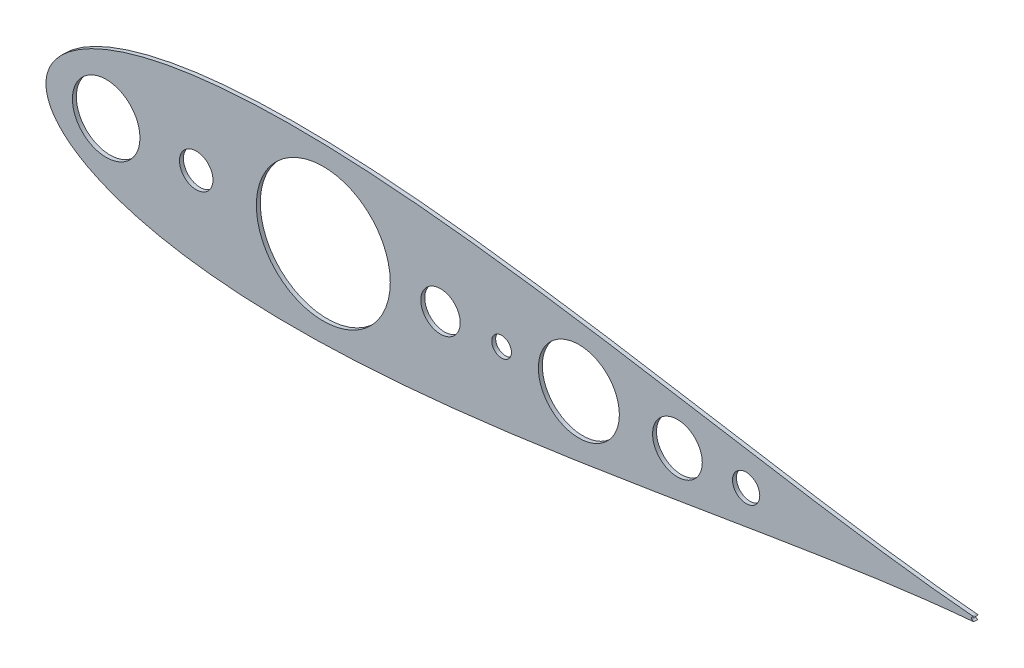
ISO-10303-21;
HEADER;
FILE_DESCRIPTION(('STEP AP214'),'2;1');
FILE_NAME('part.step','',(''),(''),'','','');
FILE_SCHEMA(('AUTOMOTIVE_DESIGN { 1 0 10303 214 1 1 1 1 }'));
ENDSEC;
DATA;
#1=APPLICATION_CONTEXT('core data for automotive mechanical design processes');
#2=APPLICATION_PROTOCOL_DEFINITION('international standard','automotive_design',2000,#1);
#3=PRODUCT_CONTEXT('',#1,'mechanical');
#4=PRODUCT('Part','Part','',(#3));
#5=PRODUCT_RELATED_PRODUCT_CATEGORY('part','',(#4));
#6=PRODUCT_DEFINITION_FORMATION('','',#4);
#7=PRODUCT_DEFINITION_CONTEXT('part definition',#1,'design');
#8=PRODUCT_DEFINITION('design','',#6,#7);
#9=PRODUCT_DEFINITION_SHAPE('','',#8);
#10=(LENGTH_UNIT() NAMED_UNIT(*) SI_UNIT(.MILLI.,.METRE.));
#11=(NAMED_UNIT(*) PLANE_ANGLE_UNIT() SI_UNIT($,.RADIAN.));
#12=(NAMED_UNIT(*) SI_UNIT($,.STERADIAN.) SOLID_ANGLE_UNIT());
#13=UNCERTAINTY_MEASURE_WITH_UNIT(LENGTH_MEASURE(1.E-05),#10,'distance_accuracy_value','');
#14=(GEOMETRIC_REPRESENTATION_CONTEXT(3) GLOBAL_UNCERTAINTY_ASSIGNED_CONTEXT((#13)) GLOBAL_UNIT_ASSIGNED_CONTEXT((#10,
#11,#12)) REPRESENTATION_CONTEXT('',''));
#15=CARTESIAN_POINT('',(0.,0.,0.));
#16=DIRECTION('',(0.,0.,1.));
#17=DIRECTION('',(1.,0.,0.));
#18=AXIS2_PLACEMENT_3D('',#15,#16,#17);
#19=CARTESIAN_POINT('',(-96.8502000029541,3.77820742338118E-09,2.53999999999976));
#20=DIRECTION('',(0.,0.,0.999999999999998));
#21=DIRECTION('',(1.,0.,0.));
#22=AXIS2_PLACEMENT_3D('',#19,#20,#21);
#23=PLANE('',#22);
#24=CARTESIAN_POINT('',(246.65660847904,0.,2.53999999999976));
#25=DIRECTION('',(0.,0.,0.999999999999998));
#26=DIRECTION('',(1.,0.,0.));
#27=AXIS2_PLACEMENT_3D('',#24,#25,#26);
#28=CIRCLE('',#27,26.1031659501041);
#29=CARTESIAN_POINT('',(272.759774429144,0.,2.53999999999976));
#30=VERTEX_POINT('',#29);
#31=EDGE_CURVE('E203',#30,#30,#28,.T.);
#32=ORIENTED_EDGE('',*,*,#31,.F.);
#33=EDGE_LOOP('',(#32));
#34=FACE_BOUND('',#33,.T.);
#35=CARTESIAN_POINT('',(354.48626357368,-1.5908517438254E-13,2.53999999999976));
#36=DIRECTION('',(0.,0.,0.999999999999998));
#37=DIRECTION('',(1.,0.,0.));
#38=AXIS2_PLACEMENT_3D('',#35,#36,#37);
#39=CIRCLE('',#38,8.77991454979843);
#40=CARTESIAN_POINT('',(363.266178123479,-1.5908517438254E-13,2.53999999999976));
#41=VERTEX_POINT('',#40);
#42=EDGE_CURVE('E188',#41,#41,#39,.T.);
#43=ORIENTED_EDGE('',*,*,#42,.F.);
#44=EDGE_LOOP('',(#43));
#45=FACE_BOUND('',#44,.T.);
#46=CARTESIAN_POINT('',(196.85,0.,2.53999999999976));
#47=DIRECTION('',(0.,0.,0.999999999999998));
#48=DIRECTION('',(1.,0.,0.));
#49=AXIS2_PLACEMENT_3D('',#46,#47,#48);
#50=CIRCLE('',#49,6.35000000000008);
#51=CARTESIAN_POINT('',(203.2,0.,2.53999999999976));
#52=VERTEX_POINT('',#51);
#53=EDGE_CURVE('E172',#52,#52,#50,.T.);
#54=ORIENTED_EDGE('',*,*,#53,.F.);
#55=EDGE_LOOP('',(#54));
#56=FACE_BOUND('',#55,.T.);
#57=CARTESIAN_POINT('',(0.,0.,2.53999999999976));
#58=DIRECTION('',(0.,0.,0.999999999999998));
#59=DIRECTION('',(1.,0.,0.));
#60=AXIS2_PLACEMENT_3D('',#57,#58,#59);
#61=CIRCLE('',#60,10.795);
#62=CARTESIAN_POINT('',(10.795,0.,2.53999999999976));
#63=VERTEX_POINT('',#62);
#64=EDGE_CURVE('E134',#63,#63,#61,.T.);
#65=ORIENTED_EDGE('',*,*,#64,.F.);
#66=EDGE_LOOP('',(#65));
#67=FACE_BOUND('',#66,.T.);
#68=CARTESIAN_POINT('',(500.684889832727,1.47129637578877,2.53999999999976));
#69=CARTESIAN_POINT('',(500.203654886732,1.51131569020501,2.53999999999976));
#70=CARTESIAN_POINT('',(496.576967435612,1.81679816270618,2.53999999999976));
#71=CARTESIAN_POINT('',(489.434650236646,2.4769485124724,2.53999999999976));
#72=CARTESIAN_POINT('',(478.832935496631,3.57980591137699,2.53999999999976));
#73=CARTESIAN_POINT('',(467.07853931356,4.93311895836878,2.53999999999976));
#74=CARTESIAN_POINT('',(454.215647937128,6.54500046738107,2.53999999999976));
#75=CARTESIAN_POINT('',(440.30427230571,8.41709162052653,2.53999999999976));
#76=CARTESIAN_POINT('',(425.40457178013,10.545195254945,2.53999999999976));
#77=CARTESIAN_POINT('',(409.581067446624,12.9183188024482,2.53999999999976));
#78=CARTESIAN_POINT('',(392.900953598627,15.5195803040389,2.53999999999976));
#79=CARTESIAN_POINT('',(375.434110153833,18.3257538503156,2.53999999999976));
#80=CARTESIAN_POINT('',(357.252720565313,21.3078555226196,2.53999999999976));
#81=CARTESIAN_POINT('',(338.431061990196,24.4315055397159,2.53999999999976));
#82=CARTESIAN_POINT('',(319.045264622353,27.657276915494,2.53999999999976));
#83=CARTESIAN_POINT('',(299.17318412093,30.9414014359741,2.53999999999976));
#84=CARTESIAN_POINT('',(278.894273560953,34.2362951107011,2.53999999999976));
#85=CARTESIAN_POINT('',(258.28951645273,37.4913381802728,2.53999999999976));
#86=CARTESIAN_POINT('',(237.441382849572,40.6535573588189,2.53999999999976));
#87=CARTESIAN_POINT('',(216.433826056586,43.668566138567,2.53999999999976));
#88=CARTESIAN_POINT('',(195.352272800007,46.4812548262623,2.53999999999976));
#89=CARTESIAN_POINT('',(174.283643961756,49.0367728183969,2.53999999999976));
#90=CARTESIAN_POINT('',(153.316369016064,51.2813169445907,2.53999999999976));
#91=CARTESIAN_POINT('',(132.540399541543,53.1630815645665,2.53999999999976));
#92=CARTESIAN_POINT('',(112.047200631443,54.633014280075,2.53999999999976));
#93=CARTESIAN_POINT('',(91.9297491144909,55.6457331849992,2.53999999999976));
#94=CARTESIAN_POINT('',(72.2825133299653,56.1603807159495,2.53999999999976));
#95=CARTESIAN_POINT('',(53.2014209917539,56.1412740352254,2.53999999999976));
#96=CARTESIAN_POINT('',(34.7838914570601,55.5581031204121,2.53999999999976));
#97=CARTESIAN_POINT('',(17.1288372498444,54.3880350403485,2.53999999999976));
#98=CARTESIAN_POINT('',(0.3369514843376,52.6141026607641,2.53999999999976));
#99=CARTESIAN_POINT('',(-15.4891326713303,50.2283097390018,2.53999999999976));
#100=CARTESIAN_POINT('',(-30.2438826455875,47.2298193665639,2.53999999999976));
#101=CARTESIAN_POINT('',(-43.8181499589832,43.6286650547727,2.53999999999976));
#102=CARTESIAN_POINT('',(-56.0971774760284,39.4459522916723,2.53999999999976));
#103=CARTESIAN_POINT('',(-66.9584699307936,34.7189497504188,2.53999999999976));
#104=CARTESIAN_POINT('',(-76.2701301439071,29.5102534688845,2.53999999999976));
#105=CARTESIAN_POINT('',(-83.893046125715,23.9255632623146,2.53999999999976));
#106=CARTESIAN_POINT('',(-89.6988566680927,18.1472831014575,2.53999999999976));
#107=CARTESIAN_POINT('',(-93.6294832038793,12.4809296149927,2.53999999999976));
#108=CARTESIAN_POINT('',(-95.8213101013169,7.36875217806998,2.53999999999976));
#109=CARTESIAN_POINT('',(-96.7064112320907,3.26783085579577,2.53999999999976));
#110=CARTESIAN_POINT('',(-96.9080009887283,3.77797843988235E-09,2.53999999999976));
#111=CARTESIAN_POINT('',(-96.7064112320907,-3.26783084824001,2.53999999999976));
#112=CARTESIAN_POINT('',(-95.8213101013169,-7.36875217051411,2.53999999999976));
#113=CARTESIAN_POINT('',(-93.6294832038793,-12.4809296074369,2.53999999999976));
#114=CARTESIAN_POINT('',(-89.6988566680928,-18.1472830939015,2.53999999999976));
#115=CARTESIAN_POINT('',(-83.893046125715,-23.9255632547589,2.53999999999976));
#116=CARTESIAN_POINT('',(-76.270130143907,-29.5102534613288,2.53999999999976));
#117=CARTESIAN_POINT('',(-66.9584699307936,-34.718949742863,2.53999999999976));
#118=CARTESIAN_POINT('',(-56.0971774760283,-39.4459522841168,2.53999999999976));
#119=CARTESIAN_POINT('',(-43.8181499589832,-43.6286650472169,2.53999999999976));
#120=CARTESIAN_POINT('',(-30.2438826455875,-47.2298193590082,2.53999999999976));
#121=CARTESIAN_POINT('',(-15.4891326713303,-50.228309731446,2.53999999999976));
#122=CARTESIAN_POINT('',(0.336951484337711,-52.6141026532085,2.53999999999976));
#123=CARTESIAN_POINT('',(17.1288372498441,-54.3880350327927,2.53999999999976));
#124=CARTESIAN_POINT('',(34.7838914570601,-55.5581031128562,2.53999999999976));
#125=CARTESIAN_POINT('',(53.2014209917539,-56.1412740276696,2.53999999999976));
#126=CARTESIAN_POINT('',(72.282513329965,-56.1603807083937,2.53999999999976));
#127=CARTESIAN_POINT('',(91.9297491144909,-55.6457331774434,2.53999999999976));
#128=CARTESIAN_POINT('',(112.047200631443,-54.6330142725192,2.53999999999976));
#129=CARTESIAN_POINT('',(132.540399541543,-53.1630815570107,2.53999999999976));
#130=CARTESIAN_POINT('',(153.316369016064,-51.2813169370346,2.53999999999976));
#131=CARTESIAN_POINT('',(174.283643961756,-49.0367728108412,2.53999999999976));
#132=CARTESIAN_POINT('',(195.352272800007,-46.4812548187066,2.53999999999976));
#133=CARTESIAN_POINT('',(216.433826056586,-43.6685661310111,2.53999999999976));
#134=CARTESIAN_POINT('',(237.441382849572,-40.6535573512632,2.53999999999976));
#135=CARTESIAN_POINT('',(258.28951645273,-37.491338172717,2.53999999999976));
#136=CARTESIAN_POINT('',(278.894273560954,-34.2362951031456,2.53999999999976));
#137=CARTESIAN_POINT('',(299.17318412093,-30.9414014284185,2.53999999999976));
#138=CARTESIAN_POINT('',(319.045264622353,-27.657276907938,2.53999999999976));
#139=CARTESIAN_POINT('',(338.431061990196,-24.4315055321601,2.53999999999976));
#140=CARTESIAN_POINT('',(357.252720565313,-21.3078555150639,2.53999999999976));
#141=CARTESIAN_POINT('',(375.434110153833,-18.3257538427601,2.53999999999976));
#142=CARTESIAN_POINT('',(392.900953598627,-15.5195802964833,2.53999999999976));
#143=CARTESIAN_POINT('',(409.581067446624,-12.9183187948922,2.53999999999976));
#144=CARTESIAN_POINT('',(425.40457178013,-10.5451952473894,2.53999999999976));
#145=CARTESIAN_POINT('',(440.30427230571,-8.41709161297103,2.53999999999976));
#146=CARTESIAN_POINT('',(454.215647937127,-6.54500045982587,2.53999999999976));
#147=CARTESIAN_POINT('',(467.07853931356,-4.93311895081337,2.53999999999976));
#148=CARTESIAN_POINT('',(478.83293549663,-3.57980590382138,2.53999999999976));
#149=CARTESIAN_POINT('',(489.434650236646,-2.47694850491707,2.53999999999976));
#150=CARTESIAN_POINT('',(496.576967435612,-1.81679815515038,2.53999999999976));
#151=CARTESIAN_POINT('',(500.203654886732,-1.51131568264918,2.53999999999976));
#152=CARTESIAN_POINT('',(500.684889832727,-1.47129637316293,2.53999999999976));
#153=B_SPLINE_CURVE_WITH_KNOTS('',3,(#68,#69,#70,#71,#72,#73,#74,#75,#76,#77,#78,#79,#80,#81,
#82,#83,#84,#85,#86,#87,#88,#89,#90,#91,#92,#93,#94,#95,#96,#97,#98,#99,#100,#101,#102,#103,
#104,#105,#106,#107,#108,#109,#110,#111,#112,#113,#114,#115,#116,#117,#118,#119,#120,#121,#122,
#123,#124,#125,#126,#127,#128,#129,#130,#131,#132,#133,#134,#135,#136,#137,#138,#139,#140,#141,
#142,#143,#144,#145,#146,#147,#148,#149,#150,#151,#152),.UNSPECIFIED.,.F.,.F.,(4,1,1,1,1,1,1,1,
1,1,1,1,1,1,1,1,1,1,1,1,1,1,1,1,1,1,1,1,1,1,1,1,1,1,1,1,1,1,1,1,1,1,1,1,1,1,1,1,1,1,1,1,1,1,1,1,
1,1,1,1,1,1,1,1,1,1,1,1,1,1,1,1,1,1,1,1,1,1,1,1,1,1,4),(0.020157042076269,0.0212708876900959,
0.0285525550130683,0.0367806836725549,0.0459201019032637,0.0559317636633187,0.0667728836144854,
0.0783971303496518,0.0907548266908363,0.103793164577546,0.117456431914319,0.131686225652521,
0.146421738497113,0.161599998000845,0.177156132626574,0.193023668070302,0.209134785631037,
0.225420632511523,0.241811601924249,0.258237646860869,0.274628556698349,0.290914287398014,
0.307025228908797,0.322892517177238,0.33844834182358,0.353626206573582,0.368361231970712,
0.382590427827798,0.396252960572084,0.40929041186716,0.421647009590257,0.433269881487031,
0.444109248914041,0.454118639688981,0.463255054987312,0.471479113777303,0.478755288570903,
0.485052318112802,0.490344025694165,0.494609832614287,0.497833231437255,0.5,0.502166768562745,
0.505390167385713,0.509655974305835,0.514947681887198,0.521244711429097,0.528520886222697,
0.536744945012688,0.545881360311019,0.555890751085959,0.566730118512969,0.578352990409744,
0.59070958813284,0.603747039427916,0.617409572172202,0.631638768029288,0.646373793426418,
0.66155165817642,0.677107482822761,0.692974771091203,0.709085712601986,0.725371443301651,
0.741762353139131,0.758188398075751,0.774579367488477,0.790865214368963,0.806976331929698,
0.822843867373426,0.838400001999155,0.853578261502887,0.868313774347479,0.882543568085681,
0.896206835422454,0.909245173309164,0.921602869650348,0.933227116385514,0.944068236336681,
0.954079898096736,0.963219316327445,0.971447444986932,0.978729112309904,0.979842957923731),.UNSPECIFIED.);
#154=CARTESIAN_POINT('',(500.684889832727,1.47129637578877,2.53999999999976));
#155=VERTEX_POINT('',#154);
#156=CARTESIAN_POINT('',(500.684889832727,-1.47129637316293,2.53999999999976));
#157=VERTEX_POINT('',#156);
#158=EDGE_CURVE('E111',#155,#157,#153,.T.);
#159=ORIENTED_EDGE('',*,*,#158,.T.);
#160=CARTESIAN_POINT('',(500.562537392799,-1.53328229209231E-10,2.53999999999976));
#161=DIRECTION('',(0.,0.,0.999999999999998));
#162=DIRECTION('',(1.,0.,0.));
#163=AXIS2_PLACEMENT_3D('',#160,#161,#162);
#164=CIRCLE('',#163,1.4763749987006);
#165=CARTESIAN_POINT('',(501.417120593675,-1.20389812274044,2.53999999999976));
#166=VERTEX_POINT('',#165);
#167=EDGE_CURVE('E106',#157,#166,#164,.T.);
#168=ORIENTED_EDGE('',*,*,#167,.T.);
#169=CARTESIAN_POINT('',(501.100967433104,-0.000122255287788632,2.53999999999976));
#170=DIRECTION('',(0.,0.,-0.999999999999998));
#171=DIRECTION('',(1.,0.,0.));
#172=AXIS2_PLACEMENT_3D('',#169,#170,#171);
#173=CIRCLE('',#172,1.2446000000002);
#174=CARTESIAN_POINT('',(501.417667224222,1.20350991539669,2.53999999999976));
#175=VERTEX_POINT('',#174);
#176=EDGE_CURVE('E109',#166,#175,#173,.T.);
#177=ORIENTED_EDGE('',*,*,#176,.T.);
#178=CARTESIAN_POINT('',(500.562537392799,-1.53328229209231E-10,2.53999999999976));
#179=DIRECTION('',(0.,0.,0.999999999999998));
#180=DIRECTION('',(1.,0.,0.));
#181=AXIS2_PLACEMENT_3D('',#178,#179,#180);
#182=CIRCLE('',#181,1.47637500162256);
#183=EDGE_CURVE('E71',#175,#155,#182,.T.);
#184=ORIENTED_EDGE('',*,*,#183,.T.);
#185=EDGE_LOOP('',(#159,#168,#177,#184));
#186=FACE_BOUND('',#185,.T.);
#187=CARTESIAN_POINT('',(157.48,0.,2.53999999999976));
#188=DIRECTION('',(0.,0.,0.999999999999998));
#189=DIRECTION('',(1.,0.,0.));
#190=AXIS2_PLACEMENT_3D('',#187,#188,#189);
#191=CIRCLE('',#190,12.6999999999999);
#192=CARTESIAN_POINT('',(170.18,0.,2.53999999999976));
#193=VERTEX_POINT('',#192);
#194=EDGE_CURVE('E165',#193,#193,#191,.T.);
#195=ORIENTED_EDGE('',*,*,#194,.F.);
#196=EDGE_LOOP('',(#195));
#197=FACE_BOUND('',#196,.T.);
#198=CARTESIAN_POINT('',(310.19216791008,0.,2.53999999999976));
#199=DIRECTION('',(0.,0.,0.999999999999998));
#200=DIRECTION('',(1.,0.,0.));
#201=AXIS2_PLACEMENT_3D('',#198,#199,#200);
#202=CIRCLE('',#201,16.0287708249209);
#203=CARTESIAN_POINT('',(326.220938735001,0.,2.53999999999976));
#204=VERTEX_POINT('',#203);
#205=EDGE_CURVE('E180',#204,#204,#202,.T.);
#206=ORIENTED_EDGE('',*,*,#205,.F.);
#207=EDGE_LOOP('',(#206));
#208=FACE_BOUND('',#207,.T.);
#209=CARTESIAN_POINT('',(-58.0581971168,0.,2.53999999999976));
#210=DIRECTION('',(0.,0.,0.999999999999998));
#211=DIRECTION('',(1.,0.,0.));
#212=AXIS2_PLACEMENT_3D('',#209,#210,#211);
#213=CIRCLE('',#212,21.763413500204);
#214=CARTESIAN_POINT('',(-36.294783616596,0.,2.53999999999976));
#215=VERTEX_POINT('',#214);
#216=EDGE_CURVE('E196',#215,#215,#213,.T.);
#217=ORIENTED_EDGE('',*,*,#216,.F.);
#218=EDGE_LOOP('',(#217));
#219=FACE_BOUND('',#218,.T.);
#220=CARTESIAN_POINT('',(81.9193617286399,0.,2.53999999999976));
#221=DIRECTION('',(0.,0.,0.999999999999998));
#222=DIRECTION('',(1.,0.,0.));
#223=AXIS2_PLACEMENT_3D('',#220,#221,#222);
#224=CIRCLE('',#223,43.1669528798076);
#225=CARTESIAN_POINT('',(125.086314608448,0.,2.53999999999976));
#226=VERTEX_POINT('',#225);
#227=EDGE_CURVE('E211',#226,#226,#224,.T.);
#228=ORIENTED_EDGE('',*,*,#227,.F.);
#229=EDGE_LOOP('',(#228));
#230=FACE_BOUND('',#229,.T.);
#231=ADVANCED_FACE('F49',(#34,#45,#56,#67,#186,#197,#208,#219,#230),#23,.T.);
#232=CARTESIAN_POINT('',(-96.8502000029541,3.77820742338118E-09,0.));
#233=DIRECTION('',(0.,0.,0.999999999999998));
#234=DIRECTION('',(1.,0.,0.));
#235=AXIS2_PLACEMENT_3D('',#232,#233,#234);
#236=PLANE('',#235);
#237=CARTESIAN_POINT('',(500.684889832727,1.47129637578877,0.));
#238=CARTESIAN_POINT('',(500.203654886732,1.51131569020501,0.));
#239=CARTESIAN_POINT('',(496.576967435612,1.81679816270618,0.));
#240=CARTESIAN_POINT('',(489.434650236646,2.4769485124724,0.));
#241=CARTESIAN_POINT('',(478.832935496631,3.57980591137699,0.));
#242=CARTESIAN_POINT('',(467.07853931356,4.93311895836878,0.));
#243=CARTESIAN_POINT('',(454.215647937128,6.54500046738107,0.));
#244=CARTESIAN_POINT('',(440.30427230571,8.41709162052653,0.));
#245=CARTESIAN_POINT('',(425.40457178013,10.545195254945,0.));
#246=CARTESIAN_POINT('',(409.581067446624,12.9183188024482,0.));
#247=CARTESIAN_POINT('',(392.900953598627,15.5195803040389,0.));
#248=CARTESIAN_POINT('',(375.434110153833,18.3257538503156,0.));
#249=CARTESIAN_POINT('',(357.252720565313,21.3078555226196,0.));
#250=CARTESIAN_POINT('',(338.431061990196,24.4315055397159,0.));
#251=CARTESIAN_POINT('',(319.045264622353,27.657276915494,0.));
#252=CARTESIAN_POINT('',(299.17318412093,30.9414014359741,0.));
#253=CARTESIAN_POINT('',(278.894273560953,34.2362951107011,0.));
#254=CARTESIAN_POINT('',(258.28951645273,37.4913381802728,0.));
#255=CARTESIAN_POINT('',(237.441382849572,40.6535573588189,0.));
#256=CARTESIAN_POINT('',(216.433826056586,43.668566138567,0.));
#257=CARTESIAN_POINT('',(195.352272800007,46.4812548262623,0.));
#258=CARTESIAN_POINT('',(174.283643961756,49.0367728183969,0.));
#259=CARTESIAN_POINT('',(153.316369016064,51.2813169445907,0.));
#260=CARTESIAN_POINT('',(132.540399541543,53.1630815645665,0.));
#261=CARTESIAN_POINT('',(112.047200631443,54.633014280075,0.));
#262=CARTESIAN_POINT('',(91.9297491144909,55.6457331849992,0.));
#263=CARTESIAN_POINT('',(72.2825133299653,56.1603807159495,0.));
#264=CARTESIAN_POINT('',(53.2014209917539,56.1412740352254,0.));
#265=CARTESIAN_POINT('',(34.7838914570601,55.5581031204121,0.));
#266=CARTESIAN_POINT('',(17.1288372498444,54.3880350403485,0.));
#267=CARTESIAN_POINT('',(0.3369514843376,52.6141026607641,0.));
#268=CARTESIAN_POINT('',(-15.4891326713303,50.2283097390018,0.));
#269=CARTESIAN_POINT('',(-30.2438826455875,47.2298193665639,0.));
#270=CARTESIAN_POINT('',(-43.8181499589832,43.6286650547727,0.));
#271=CARTESIAN_POINT('',(-56.0971774760284,39.4459522916723,0.));
#272=CARTESIAN_POINT('',(-66.9584699307936,34.7189497504188,0.));
#273=CARTESIAN_POINT('',(-76.2701301439071,29.5102534688845,0.));
#274=CARTESIAN_POINT('',(-83.893046125715,23.9255632623146,0.));
#275=CARTESIAN_POINT('',(-89.6988566680927,18.1472831014575,0.));
#276=CARTESIAN_POINT('',(-93.6294832038793,12.4809296149927,0.));
#277=CARTESIAN_POINT('',(-95.8213101013169,7.36875217806998,0.));
#278=CARTESIAN_POINT('',(-96.7064112320907,3.26783085579577,0.));
#279=CARTESIAN_POINT('',(-96.9080009887283,3.77797843988235E-09,0.));
#280=CARTESIAN_POINT('',(-96.7064112320907,-3.26783084824001,0.));
#281=CARTESIAN_POINT('',(-95.8213101013169,-7.36875217051411,0.));
#282=CARTESIAN_POINT('',(-93.6294832038793,-12.4809296074369,0.));
#283=CARTESIAN_POINT('',(-89.6988566680928,-18.1472830939015,0.));
#284=CARTESIAN_POINT('',(-83.893046125715,-23.9255632547589,0.));
#285=CARTESIAN_POINT('',(-76.270130143907,-29.5102534613288,0.));
#286=CARTESIAN_POINT('',(-66.9584699307936,-34.718949742863,0.));
#287=CARTESIAN_POINT('',(-56.0971774760283,-39.4459522841168,0.));
#288=CARTESIAN_POINT('',(-43.8181499589832,-43.6286650472169,0.));
#289=CARTESIAN_POINT('',(-30.2438826455875,-47.2298193590082,0.));
#290=CARTESIAN_POINT('',(-15.4891326713303,-50.228309731446,0.));
#291=CARTESIAN_POINT('',(0.336951484337711,-52.6141026532085,0.));
#292=CARTESIAN_POINT('',(17.1288372498441,-54.3880350327927,0.));
#293=CARTESIAN_POINT('',(34.7838914570601,-55.5581031128562,0.));
#294=CARTESIAN_POINT('',(53.2014209917539,-56.1412740276696,0.));
#295=CARTESIAN_POINT('',(72.282513329965,-56.1603807083937,0.));
#296=CARTESIAN_POINT('',(91.9297491144909,-55.6457331774434,0.));
#297=CARTESIAN_POINT('',(112.047200631443,-54.6330142725192,0.));
#298=CARTESIAN_POINT('',(132.540399541543,-53.1630815570107,0.));
#299=CARTESIAN_POINT('',(153.316369016064,-51.2813169370346,0.));
#300=CARTESIAN_POINT('',(174.283643961756,-49.0367728108412,0.));
#301=CARTESIAN_POINT('',(195.352272800007,-46.4812548187066,0.));
#302=CARTESIAN_POINT('',(216.433826056586,-43.6685661310111,0.));
#303=CARTESIAN_POINT('',(237.441382849572,-40.6535573512632,0.));
#304=CARTESIAN_POINT('',(258.28951645273,-37.491338172717,0.));
#305=CARTESIAN_POINT('',(278.894273560954,-34.2362951031456,0.));
#306=CARTESIAN_POINT('',(299.17318412093,-30.9414014284185,0.));
#307=CARTESIAN_POINT('',(319.045264622353,-27.657276907938,0.));
#308=CARTESIAN_POINT('',(338.431061990196,-24.4315055321601,0.));
#309=CARTESIAN_POINT('',(357.252720565313,-21.3078555150639,0.));
#310=CARTESIAN_POINT('',(375.434110153833,-18.3257538427601,0.));
#311=CARTESIAN_POINT('',(392.900953598627,-15.5195802964833,0.));
#312=CARTESIAN_POINT('',(409.581067446624,-12.9183187948922,0.));
#313=CARTESIAN_POINT('',(425.40457178013,-10.5451952473894,0.));
#314=CARTESIAN_POINT('',(440.30427230571,-8.41709161297103,0.));
#315=CARTESIAN_POINT('',(454.215647937127,-6.54500045982587,0.));
#316=CARTESIAN_POINT('',(467.07853931356,-4.93311895081337,0.));
#317=CARTESIAN_POINT('',(478.83293549663,-3.57980590382138,0.));
#318=CARTESIAN_POINT('',(489.434650236646,-2.47694850491707,0.));
#319=CARTESIAN_POINT('',(496.576967435612,-1.81679815515038,0.));
#320=CARTESIAN_POINT('',(500.203654886732,-1.51131568264918,0.));
#321=CARTESIAN_POINT('',(500.684889832727,-1.47129637316293,0.));
#322=B_SPLINE_CURVE_WITH_KNOTS('',3,(#237,#238,#239,#240,#241,#242,#243,#244,#245,#246,#247,
#248,#249,#250,#251,#252,#253,#254,#255,#256,#257,#258,#259,#260,#261,#262,#263,#264,#265,#266,
#267,#268,#269,#270,#271,#272,#273,#274,#275,#276,#277,#278,#279,#280,#281,#282,#283,#284,#285,
#286,#287,#288,#289,#290,#291,#292,#293,#294,#295,#296,#297,#298,#299,#300,#301,#302,#303,#304,
#305,#306,#307,#308,#309,#310,#311,#312,#313,#314,#315,#316,#317,#318,#319,#320,#321),
.UNSPECIFIED.,.F.,.F.,(4,1,1,1,1,1,1,1,1,1,1,1,1,1,1,1,1,1,1,1,1,1,1,1,1,1,1,1,1,1,1,1,1,1,1,1,
1,1,1,1,1,1,1,1,1,1,1,1,1,1,1,1,1,1,1,1,1,1,1,1,1,1,1,1,1,1,1,1,1,1,1,1,1,1,1,1,1,1,1,1,1,1,4),
(0.020157042076269,0.0212708876900959,0.0285525550130683,0.0367806836725549,0.0459201019032637,
0.0559317636633187,0.0667728836144854,0.0783971303496518,0.0907548266908363,0.103793164577546,
0.117456431914319,0.131686225652521,0.146421738497113,0.161599998000845,0.177156132626574,
0.193023668070302,0.209134785631037,0.225420632511523,0.241811601924249,0.258237646860869,
0.274628556698349,0.290914287398014,0.307025228908797,0.322892517177238,0.33844834182358,
0.353626206573582,0.368361231970712,0.382590427827798,0.396252960572084,0.40929041186716,
0.421647009590257,0.433269881487031,0.444109248914041,0.454118639688981,0.463255054987312,
0.471479113777303,0.478755288570903,0.485052318112802,0.490344025694165,0.494609832614287,
0.497833231437255,0.5,0.502166768562745,0.505390167385713,0.509655974305835,0.514947681887198,
0.521244711429097,0.528520886222697,0.536744945012688,0.545881360311019,0.555890751085959,
0.566730118512969,0.578352990409744,0.59070958813284,0.603747039427916,0.617409572172202,
0.631638768029288,0.646373793426418,0.66155165817642,0.677107482822761,0.692974771091203,
0.709085712601986,0.725371443301651,0.741762353139131,0.758188398075751,0.774579367488477,
0.790865214368963,0.806976331929698,0.822843867373426,0.838400001999155,0.853578261502887,
0.868313774347479,0.882543568085681,0.896206835422454,0.909245173309164,0.921602869650348,
0.933227116385514,0.944068236336681,0.954079898096736,0.963219316327445,0.971447444986932,
0.978729112309904,0.979842957923731),.UNSPECIFIED.);
#323=CARTESIAN_POINT('',(500.684889832727,1.47129637578877,0.));
#324=VERTEX_POINT('',#323);
#325=CARTESIAN_POINT('',(500.684889832727,-1.47129637316293,0.));
#326=VERTEX_POINT('',#325);
#327=EDGE_CURVE('E128',#324,#326,#322,.T.);
#328=ORIENTED_EDGE('',*,*,#327,.F.);
#329=CARTESIAN_POINT('',(500.562537392799,-1.53328229209231E-10,0.));
#330=DIRECTION('',(0.,0.,0.999999999999998));
#331=DIRECTION('',(1.,0.,0.));
#332=AXIS2_PLACEMENT_3D('',#329,#330,#331);
#333=CIRCLE('',#332,1.47637500162256);
#334=CARTESIAN_POINT('',(501.417667224222,1.20350991539669,0.));
#335=VERTEX_POINT('',#334);
#336=EDGE_CURVE('E99',#335,#324,#333,.T.);
#337=ORIENTED_EDGE('',*,*,#336,.F.);
#338=CARTESIAN_POINT('',(501.100967433104,-0.000122255287788632,0.));
#339=DIRECTION('',(0.,0.,-0.999999999999998));
#340=DIRECTION('',(1.,0.,0.));
#341=AXIS2_PLACEMENT_3D('',#338,#339,#340);
#342=CIRCLE('',#341,1.2446000000002);
#343=CARTESIAN_POINT('',(501.417120593675,-1.20389812274044,0.));
#344=VERTEX_POINT('',#343);
#345=EDGE_CURVE('E93',#344,#335,#342,.T.);
#346=ORIENTED_EDGE('',*,*,#345,.F.);
#347=CARTESIAN_POINT('',(500.562537392799,-1.53328229209231E-10,0.));
#348=DIRECTION('',(0.,0.,0.999999999999998));
#349=DIRECTION('',(1.,0.,0.));
#350=AXIS2_PLACEMENT_3D('',#347,#348,#349);
#351=CIRCLE('',#350,1.4763749987006);
#352=EDGE_CURVE('E116',#326,#344,#351,.T.);
#353=ORIENTED_EDGE('',*,*,#352,.F.);
#354=EDGE_LOOP('',(#328,#337,#346,#353));
#355=FACE_BOUND('',#354,.T.);
#356=CARTESIAN_POINT('',(0.,0.,0.));
#357=DIRECTION('',(0.,0.,0.999999999999998));
#358=DIRECTION('',(1.,0.,0.));
#359=AXIS2_PLACEMENT_3D('',#356,#357,#358);
#360=CIRCLE('',#359,10.795);
#361=CARTESIAN_POINT('',(10.795,0.,0.));
#362=VERTEX_POINT('',#361);
#363=EDGE_CURVE('E158',#362,#362,#360,.T.);
#364=ORIENTED_EDGE('',*,*,#363,.T.);
#365=EDGE_LOOP('',(#364));
#366=FACE_BOUND('',#365,.T.);
#367=CARTESIAN_POINT('',(157.48,0.,0.));
#368=DIRECTION('',(0.,0.,0.999999999999998));
#369=DIRECTION('',(1.,0.,0.));
#370=AXIS2_PLACEMENT_3D('',#367,#368,#369);
#371=CIRCLE('',#370,12.6999999999999);
#372=CARTESIAN_POINT('',(170.18,0.,0.));
#373=VERTEX_POINT('',#372);
#374=EDGE_CURVE('E169',#373,#373,#371,.T.);
#375=ORIENTED_EDGE('',*,*,#374,.T.);
#376=EDGE_LOOP('',(#375));
#377=FACE_BOUND('',#376,.T.);
#378=CARTESIAN_POINT('',(196.85,0.,0.));
#379=DIRECTION('',(0.,0.,0.999999999999998));
#380=DIRECTION('',(1.,0.,0.));
#381=AXIS2_PLACEMENT_3D('',#378,#379,#380);
#382=CIRCLE('',#381,6.35000000000008);
#383=CARTESIAN_POINT('',(203.2,0.,0.));
#384=VERTEX_POINT('',#383);
#385=EDGE_CURVE('E176',#384,#384,#382,.T.);
#386=ORIENTED_EDGE('',*,*,#385,.T.);
#387=EDGE_LOOP('',(#386));
#388=FACE_BOUND('',#387,.T.);
#389=CARTESIAN_POINT('',(310.19216791008,0.,0.));
#390=DIRECTION('',(0.,0.,0.999999999999998));
#391=DIRECTION('',(1.,0.,0.));
#392=AXIS2_PLACEMENT_3D('',#389,#390,#391);
#393=CIRCLE('',#392,16.0287708249209);
#394=CARTESIAN_POINT('',(326.220938735001,0.,0.));
#395=VERTEX_POINT('',#394);
#396=EDGE_CURVE('E184',#395,#395,#393,.T.);
#397=ORIENTED_EDGE('',*,*,#396,.T.);
#398=EDGE_LOOP('',(#397));
#399=FACE_BOUND('',#398,.T.);
#400=CARTESIAN_POINT('',(354.48626357368,-1.5908517438254E-13,0.));
#401=DIRECTION('',(0.,0.,0.999999999999998));
#402=DIRECTION('',(1.,0.,0.));
#403=AXIS2_PLACEMENT_3D('',#400,#401,#402);
#404=CIRCLE('',#403,8.77991454979843);
#405=CARTESIAN_POINT('',(363.266178123479,-1.5908517438254E-13,0.));
#406=VERTEX_POINT('',#405);
#407=EDGE_CURVE('E192',#406,#406,#404,.T.);
#408=ORIENTED_EDGE('',*,*,#407,.T.);
#409=EDGE_LOOP('',(#408));
#410=FACE_BOUND('',#409,.T.);
#411=CARTESIAN_POINT('',(-58.0581971168,0.,0.));
#412=DIRECTION('',(0.,0.,0.999999999999998));
#413=DIRECTION('',(1.,0.,0.));
#414=AXIS2_PLACEMENT_3D('',#411,#412,#413);
#415=CIRCLE('',#414,21.763413500204);
#416=CARTESIAN_POINT('',(-36.294783616596,0.,0.));
#417=VERTEX_POINT('',#416);
#418=EDGE_CURVE('E200',#417,#417,#415,.T.);
#419=ORIENTED_EDGE('',*,*,#418,.T.);
#420=EDGE_LOOP('',(#419));
#421=FACE_BOUND('',#420,.T.);
#422=CARTESIAN_POINT('',(246.65660847904,0.,0.));
#423=DIRECTION('',(0.,0.,0.999999999999998));
#424=DIRECTION('',(1.,0.,0.));
#425=AXIS2_PLACEMENT_3D('',#422,#423,#424);
#426=CIRCLE('',#425,26.1031659501041);
#427=CARTESIAN_POINT('',(272.759774429144,0.,0.));
#428=VERTEX_POINT('',#427);
#429=EDGE_CURVE('E207',#428,#428,#426,.T.);
#430=ORIENTED_EDGE('',*,*,#429,.T.);
#431=EDGE_LOOP('',(#430));
#432=FACE_BOUND('',#431,.T.);
#433=CARTESIAN_POINT('',(81.9193617286399,0.,0.));
#434=DIRECTION('',(0.,0.,0.999999999999998));
#435=DIRECTION('',(1.,0.,0.));
#436=AXIS2_PLACEMENT_3D('',#433,#434,#435);
#437=CIRCLE('',#436,43.1669528798076);
#438=CARTESIAN_POINT('',(125.086314608448,0.,0.));
#439=VERTEX_POINT('',#438);
#440=EDGE_CURVE('E215',#439,#439,#437,.T.);
#441=ORIENTED_EDGE('',*,*,#440,.T.);
#442=EDGE_LOOP('',(#441));
#443=FACE_BOUND('',#442,.T.);
#444=ADVANCED_FACE('F149',(#355,#366,#377,#388,#399,#410,#421,#432,#443),#236,.F.);
#445=DIRECTION('',(0.,0.,-0.999999999999998));
#446=VECTOR('',#445,1.);
#447=SURFACE_OF_LINEAR_EXTRUSION('',#153,#446);
#448=ORIENTED_EDGE('',*,*,#327,.T.);
#449=DIRECTION('',(0.,0.,-0.999999999999998));
#450=VECTOR('',#449,1.);
#451=CARTESIAN_POINT('',(500.684889832727,-1.47129637316293,2.53999999999976));
#452=LINE('',#451,#450);
#453=EDGE_CURVE('E13',#157,#326,#452,.T.);
#454=ORIENTED_EDGE('',*,*,#453,.F.);
#455=ORIENTED_EDGE('',*,*,#158,.F.);
#456=DIRECTION('',(0.,0.,-0.999999999999998));
#457=VECTOR('',#456,1.);
#458=CARTESIAN_POINT('',(500.684889832727,1.47129637578877,2.53999999999976));
#459=LINE('',#458,#457);
#460=EDGE_CURVE('E125',#155,#324,#459,.T.);
#461=ORIENTED_EDGE('',*,*,#460,.T.);
#462=EDGE_LOOP('',(#448,#454,#455,#461));
#463=FACE_BOUND('',#462,.T.);
#464=ADVANCED_FACE('F51',(#463),#447,.F.);
#465=CARTESIAN_POINT('',(500.562537392799,-1.53328229209231E-10,2.53999999999976));
#466=DIRECTION('',(0.,0.,-0.999999999999998));
#467=DIRECTION('',(-1.,0.,0.));
#468=AXIS2_PLACEMENT_3D('',#465,#466,#467);
#469=CYLINDRICAL_SURFACE('',#468,1.4763749987006);
#470=ORIENTED_EDGE('',*,*,#352,.T.);
#471=DIRECTION('',(0.,0.,-0.999999999999998));
#472=VECTOR('',#471,1.);
#473=CARTESIAN_POINT('',(501.417120593675,-1.20389812274044,2.53999999999976));
#474=LINE('',#473,#472);
#475=EDGE_CURVE('E60',#166,#344,#474,.T.);
#476=ORIENTED_EDGE('',*,*,#475,.F.);
#477=ORIENTED_EDGE('',*,*,#167,.F.);
#478=ORIENTED_EDGE('',*,*,#453,.T.);
#479=EDGE_LOOP('',(#470,#476,#477,#478));
#480=FACE_BOUND('',#479,.T.);
#481=ADVANCED_FACE('F115',(#480),#469,.T.);
#482=CARTESIAN_POINT('',(501.100967433104,-0.000122255287788632,2.53999999999976));
#483=DIRECTION('',(0.,0.,-0.999999999999998));
#484=DIRECTION('',(-1.,0.,0.));
#485=AXIS2_PLACEMENT_3D('',#482,#483,#484);
#486=CYLINDRICAL_SURFACE('',#485,1.2446000000002);
#487=ORIENTED_EDGE('',*,*,#345,.T.);
#488=DIRECTION('',(0.,0.,-0.999999999999998));
#489=VECTOR('',#488,1.);
#490=CARTESIAN_POINT('',(501.417667224222,1.20350991539669,2.53999999999976));
#491=LINE('',#490,#489);
#492=EDGE_CURVE('E118',#175,#335,#491,.T.);
#493=ORIENTED_EDGE('',*,*,#492,.F.);
#494=ORIENTED_EDGE('',*,*,#176,.F.);
#495=ORIENTED_EDGE('',*,*,#475,.T.);
#496=EDGE_LOOP('',(#487,#493,#494,#495));
#497=FACE_BOUND('',#496,.T.);
#498=ADVANCED_FACE('F119',(#497),#486,.F.);
#499=CARTESIAN_POINT('',(500.562537392799,-1.53328229209231E-10,2.53999999999976));
#500=DIRECTION('',(0.,0.,-0.999999999999998));
#501=DIRECTION('',(-1.,0.,0.));
#502=AXIS2_PLACEMENT_3D('',#499,#500,#501);
#503=CYLINDRICAL_SURFACE('',#502,1.47637500162256);
#504=ORIENTED_EDGE('',*,*,#336,.T.);
#505=ORIENTED_EDGE('',*,*,#460,.F.);
#506=ORIENTED_EDGE('',*,*,#183,.F.);
#507=ORIENTED_EDGE('',*,*,#492,.T.);
#508=EDGE_LOOP('',(#504,#505,#506,#507));
#509=FACE_BOUND('',#508,.T.);
#510=ADVANCED_FACE('F146',(#509),#503,.T.);
#511=CARTESIAN_POINT('',(0.,0.,2.53999999999976));
#512=DIRECTION('',(0.,0.,-0.999999999999998));
#513=DIRECTION('',(-1.,0.,0.));
#514=AXIS2_PLACEMENT_3D('',#511,#512,#513);
#515=CYLINDRICAL_SURFACE('',#514,10.795);
#516=ORIENTED_EDGE('',*,*,#64,.T.);
#517=EDGE_LOOP('',(#516));
#518=FACE_BOUND('',#517,.T.);
#519=ORIENTED_EDGE('',*,*,#363,.F.);
#520=EDGE_LOOP('',(#519));
#521=FACE_BOUND('',#520,.T.);
#522=ADVANCED_FACE('F236',(#518,#521),#515,.F.);
#523=CARTESIAN_POINT('',(157.48,0.,2.53999999999976));
#524=DIRECTION('',(0.,0.,-0.999999999999998));
#525=DIRECTION('',(-1.,0.,0.));
#526=AXIS2_PLACEMENT_3D('',#523,#524,#525);
#527=CYLINDRICAL_SURFACE('',#526,12.6999999999999);
#528=ORIENTED_EDGE('',*,*,#194,.T.);
#529=EDGE_LOOP('',(#528));
#530=FACE_BOUND('',#529,.T.);
#531=ORIENTED_EDGE('',*,*,#374,.F.);
#532=EDGE_LOOP('',(#531));
#533=FACE_BOUND('',#532,.T.);
#534=ADVANCED_FACE('F273',(#530,#533),#527,.F.);
#535=CARTESIAN_POINT('',(196.85,0.,2.53999999999976));
#536=DIRECTION('',(0.,0.,-0.999999999999998));
#537=DIRECTION('',(-1.,0.,0.));
#538=AXIS2_PLACEMENT_3D('',#535,#536,#537);
#539=CYLINDRICAL_SURFACE('',#538,6.35000000000008);
#540=ORIENTED_EDGE('',*,*,#53,.T.);
#541=EDGE_LOOP('',(#540));
#542=FACE_BOUND('',#541,.T.);
#543=ORIENTED_EDGE('',*,*,#385,.F.);
#544=EDGE_LOOP('',(#543));
#545=FACE_BOUND('',#544,.T.);
#546=ADVANCED_FACE('F280',(#542,#545),#539,.F.);
#547=CARTESIAN_POINT('',(310.19216791008,0.,2.53999999999976));
#548=DIRECTION('',(0.,0.,-0.999999999999998));
#549=DIRECTION('',(-1.,0.,0.));
#550=AXIS2_PLACEMENT_3D('',#547,#548,#549);
#551=CYLINDRICAL_SURFACE('',#550,16.0287708249209);
#552=ORIENTED_EDGE('',*,*,#205,.T.);
#553=EDGE_LOOP('',(#552));
#554=FACE_BOUND('',#553,.T.);
#555=ORIENTED_EDGE('',*,*,#396,.F.);
#556=EDGE_LOOP('',(#555));
#557=FACE_BOUND('',#556,.T.);
#558=ADVANCED_FACE('F287',(#554,#557),#551,.F.);
#559=CARTESIAN_POINT('',(354.48626357368,-1.5908517438254E-13,2.53999999999976));
#560=DIRECTION('',(0.,0.,-0.999999999999998));
#561=DIRECTION('',(-1.,0.,0.));
#562=AXIS2_PLACEMENT_3D('',#559,#560,#561);
#563=CYLINDRICAL_SURFACE('',#562,8.77991454979843);
#564=ORIENTED_EDGE('',*,*,#42,.T.);
#565=EDGE_LOOP('',(#564));
#566=FACE_BOUND('',#565,.T.);
#567=ORIENTED_EDGE('',*,*,#407,.F.);
#568=EDGE_LOOP('',(#567));
#569=FACE_BOUND('',#568,.T.);
#570=ADVANCED_FACE('F295',(#566,#569),#563,.F.);
#571=CARTESIAN_POINT('',(-58.0581971168,0.,2.53999999999976));
#572=DIRECTION('',(0.,0.,-0.999999999999998));
#573=DIRECTION('',(-1.,0.,0.));
#574=AXIS2_PLACEMENT_3D('',#571,#572,#573);
#575=CYLINDRICAL_SURFACE('',#574,21.763413500204);
#576=ORIENTED_EDGE('',*,*,#216,.T.);
#577=EDGE_LOOP('',(#576));
#578=FACE_BOUND('',#577,.T.);
#579=ORIENTED_EDGE('',*,*,#418,.F.);
#580=EDGE_LOOP('',(#579));
#581=FACE_BOUND('',#580,.T.);
#582=ADVANCED_FACE('F303',(#578,#581),#575,.F.);
#583=CARTESIAN_POINT('',(246.65660847904,0.,2.53999999999976));
#584=DIRECTION('',(0.,0.,-0.999999999999998));
#585=DIRECTION('',(-1.,0.,0.));
#586=AXIS2_PLACEMENT_3D('',#583,#584,#585);
#587=CYLINDRICAL_SURFACE('',#586,26.1031659501041);
#588=ORIENTED_EDGE('',*,*,#31,.T.);
#589=EDGE_LOOP('',(#588));
#590=FACE_BOUND('',#589,.T.);
#591=ORIENTED_EDGE('',*,*,#429,.F.);
#592=EDGE_LOOP('',(#591));
#593=FACE_BOUND('',#592,.T.);
#594=ADVANCED_FACE('F311',(#590,#593),#587,.F.);
#595=CARTESIAN_POINT('',(81.9193617286399,0.,2.53999999999976));
#596=DIRECTION('',(0.,0.,-0.999999999999998));
#597=DIRECTION('',(-1.,0.,0.));
#598=AXIS2_PLACEMENT_3D('',#595,#596,#597);
#599=CYLINDRICAL_SURFACE('',#598,43.1669528798076);
#600=ORIENTED_EDGE('',*,*,#227,.T.);
#601=EDGE_LOOP('',(#600));
#602=FACE_BOUND('',#601,.T.);
#603=ORIENTED_EDGE('',*,*,#440,.F.);
#604=EDGE_LOOP('',(#603));
#605=FACE_BOUND('',#604,.T.);
#606=ADVANCED_FACE('F223',(#602,#605),#599,.F.);
#607=CLOSED_SHELL('',(#231,#444,#464,#481,#498,#510,#522,#534,#546,#558,#570,#582,#594,#606));
#608=MANIFOLD_SOLID_BREP('B2',#607);
#609=ADVANCED_BREP_SHAPE_REPRESENTATION('',(#18,#608),#14);
#610=SHAPE_DEFINITION_REPRESENTATION(#9,#609);
ENDSEC;
END-ISO-10303-21;
